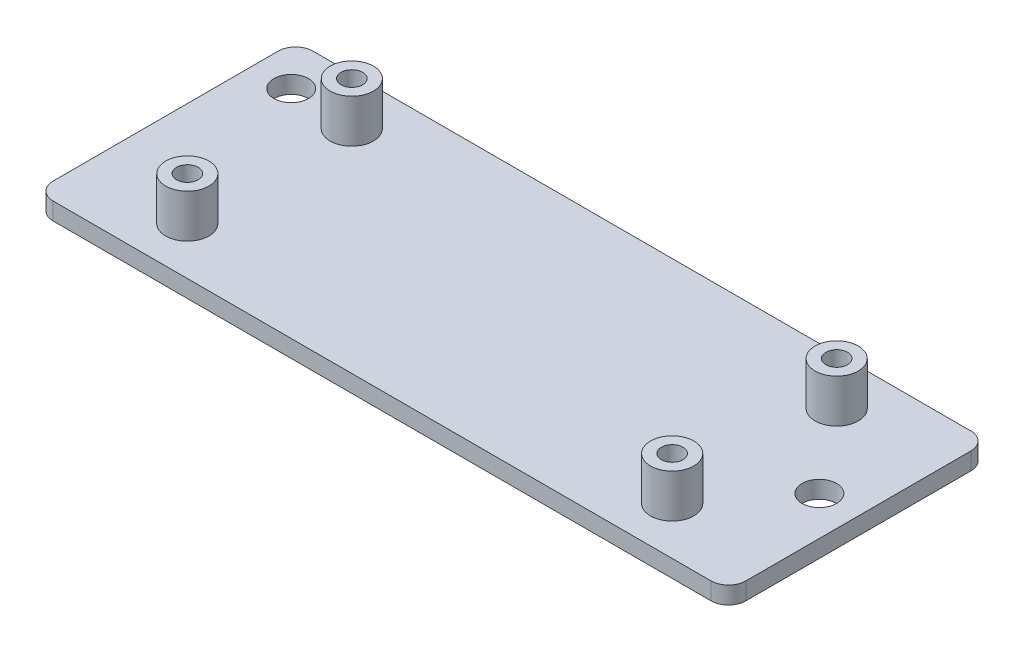
ISO-10303-21;
HEADER;
FILE_DESCRIPTION(('STEP AP214'),'2;1');
FILE_NAME('part.step','',(''),(''),'','','');
FILE_SCHEMA(('AUTOMOTIVE_DESIGN { 1 0 10303 214 1 1 1 1 }'));
ENDSEC;
DATA;
#1=APPLICATION_CONTEXT('core data for automotive mechanical design processes');
#2=APPLICATION_PROTOCOL_DEFINITION('international standard','automotive_design',2000,#1);
#3=PRODUCT_CONTEXT('',#1,'mechanical');
#4=PRODUCT('Part','Part','',(#3));
#5=PRODUCT_RELATED_PRODUCT_CATEGORY('part','',(#4));
#6=PRODUCT_DEFINITION_FORMATION('','',#4);
#7=PRODUCT_DEFINITION_CONTEXT('part definition',#1,'design');
#8=PRODUCT_DEFINITION('design','',#6,#7);
#9=PRODUCT_DEFINITION_SHAPE('','',#8);
#10=(LENGTH_UNIT() NAMED_UNIT(*) SI_UNIT(.MILLI.,.METRE.));
#11=(NAMED_UNIT(*) PLANE_ANGLE_UNIT() SI_UNIT($,.RADIAN.));
#12=(NAMED_UNIT(*) SI_UNIT($,.STERADIAN.) SOLID_ANGLE_UNIT());
#13=UNCERTAINTY_MEASURE_WITH_UNIT(LENGTH_MEASURE(1.E-05),#10,'distance_accuracy_value','');
#14=(GEOMETRIC_REPRESENTATION_CONTEXT(3) GLOBAL_UNCERTAINTY_ASSIGNED_CONTEXT((#13)) GLOBAL_UNIT_ASSIGNED_CONTEXT((#10,
#11,#12)) REPRESENTATION_CONTEXT('',''));
#15=CARTESIAN_POINT('',(0.,0.,0.));
#16=DIRECTION('',(0.,0.,1.));
#17=DIRECTION('',(1.,0.,0.));
#18=AXIS2_PLACEMENT_3D('',#15,#16,#17);
#19=CARTESIAN_POINT('',(78.,2.,28.));
#20=DIRECTION('',(0.,-1.,0.));
#21=DIRECTION('',(0.,0.,-1.));
#22=AXIS2_PLACEMENT_3D('',#19,#20,#21);
#23=CYLINDRICAL_SURFACE('',#22,2.);
#24=DIRECTION('',(0.,-1.,0.));
#25=VECTOR('',#24,1.);
#26=CARTESIAN_POINT('',(80.,2.,28.));
#27=LINE('',#26,#25);
#28=CARTESIAN_POINT('',(80.,2.,28.));
#29=VERTEX_POINT('',#28);
#30=CARTESIAN_POINT('',(80.,0.,28.));
#31=VERTEX_POINT('',#30);
#32=EDGE_CURVE('E150',#29,#31,#27,.T.);
#33=ORIENTED_EDGE('',*,*,#32,.F.);
#34=CARTESIAN_POINT('',(78.,2.,28.));
#35=DIRECTION('',(0.,1.,0.));
#36=DIRECTION('',(0.,0.,1.));
#37=AXIS2_PLACEMENT_3D('',#34,#35,#36);
#38=CIRCLE('',#37,2.);
#39=CARTESIAN_POINT('',(78.,2.,30.));
#40=VERTEX_POINT('',#39);
#41=EDGE_CURVE('E42',#40,#29,#38,.T.);
#42=ORIENTED_EDGE('',*,*,#41,.F.);
#43=DIRECTION('',(0.,-1.,0.));
#44=VECTOR('',#43,1.);
#45=CARTESIAN_POINT('',(78.,2.,30.));
#46=LINE('',#45,#44);
#47=CARTESIAN_POINT('',(78.,0.,30.));
#48=VERTEX_POINT('',#47);
#49=EDGE_CURVE('E153',#48,#40,#46,.F.);
#50=ORIENTED_EDGE('',*,*,#49,.F.);
#51=CARTESIAN_POINT('',(78.,0.,28.));
#52=DIRECTION('',(0.,1.,0.));
#53=DIRECTION('',(0.,0.,1.));
#54=AXIS2_PLACEMENT_3D('',#51,#52,#53);
#55=CIRCLE('',#54,2.);
#56=EDGE_CURVE('E11',#31,#48,#55,.F.);
#57=ORIENTED_EDGE('',*,*,#56,.F.);
#58=EDGE_LOOP('',(#33,#42,#50,#57));
#59=FACE_BOUND('',#58,.T.);
#60=ADVANCED_FACE('F35',(#59),#23,.T.);
#61=CARTESIAN_POINT('',(78.,2.,2.));
#62=DIRECTION('',(0.,-1.,0.));
#63=DIRECTION('',(0.,0.,-1.));
#64=AXIS2_PLACEMENT_3D('',#61,#62,#63);
#65=CYLINDRICAL_SURFACE('',#64,2.);
#66=DIRECTION('',(0.,-1.,0.));
#67=VECTOR('',#66,1.);
#68=CARTESIAN_POINT('',(78.,2.,0.));
#69=LINE('',#68,#67);
#70=CARTESIAN_POINT('',(78.,2.,0.));
#71=VERTEX_POINT('',#70);
#72=CARTESIAN_POINT('',(78.,0.,0.));
#73=VERTEX_POINT('',#72);
#74=EDGE_CURVE('E139',#71,#73,#69,.T.);
#75=ORIENTED_EDGE('',*,*,#74,.F.);
#76=CARTESIAN_POINT('',(78.,2.,2.));
#77=DIRECTION('',(0.,1.,0.));
#78=DIRECTION('',(0.,0.,1.));
#79=AXIS2_PLACEMENT_3D('',#76,#77,#78);
#80=CIRCLE('',#79,2.);
#81=CARTESIAN_POINT('',(80.,2.,2.));
#82=VERTEX_POINT('',#81);
#83=EDGE_CURVE('E145',#82,#71,#80,.T.);
#84=ORIENTED_EDGE('',*,*,#83,.F.);
#85=DIRECTION('',(0.,-1.,0.));
#86=VECTOR('',#85,1.);
#87=CARTESIAN_POINT('',(80.,2.,2.));
#88=LINE('',#87,#86);
#89=CARTESIAN_POINT('',(80.,0.,2.));
#90=VERTEX_POINT('',#89);
#91=EDGE_CURVE('E142',#90,#82,#88,.F.);
#92=ORIENTED_EDGE('',*,*,#91,.F.);
#93=CARTESIAN_POINT('',(78.,0.,2.));
#94=DIRECTION('',(0.,1.,0.));
#95=DIRECTION('',(0.,0.,1.));
#96=AXIS2_PLACEMENT_3D('',#93,#94,#95);
#97=CIRCLE('',#96,2.);
#98=EDGE_CURVE('E147',#73,#90,#97,.F.);
#99=ORIENTED_EDGE('',*,*,#98,.F.);
#100=EDGE_LOOP('',(#75,#84,#92,#99));
#101=FACE_BOUND('',#100,.T.);
#102=ADVANCED_FACE('F223',(#101),#65,.T.);
#103=CARTESIAN_POINT('',(2.,2.,2.));
#104=DIRECTION('',(0.,1.,0.));
#105=DIRECTION('',(0.,0.,1.));
#106=AXIS2_PLACEMENT_3D('',#103,#104,#105);
#107=CYLINDRICAL_SURFACE('',#106,2.);
#108=DIRECTION('',(0.,1.,0.));
#109=VECTOR('',#108,1.);
#110=CARTESIAN_POINT('',(2.,2.,0.));
#111=LINE('',#110,#109);
#112=CARTESIAN_POINT('',(2.,0.,0.));
#113=VERTEX_POINT('',#112);
#114=CARTESIAN_POINT('',(2.,2.,0.));
#115=VERTEX_POINT('',#114);
#116=EDGE_CURVE('E131',#113,#115,#111,.T.);
#117=ORIENTED_EDGE('',*,*,#116,.F.);
#118=CARTESIAN_POINT('',(2.,0.,2.));
#119=DIRECTION('',(0.,1.,0.));
#120=DIRECTION('',(0.,0.,1.));
#121=AXIS2_PLACEMENT_3D('',#118,#119,#120);
#122=CIRCLE('',#121,2.);
#123=CARTESIAN_POINT('',(0.,0.,2.));
#124=VERTEX_POINT('',#123);
#125=EDGE_CURVE('E135',#124,#113,#122,.F.);
#126=ORIENTED_EDGE('',*,*,#125,.F.);
#127=DIRECTION('',(0.,1.,0.));
#128=VECTOR('',#127,1.);
#129=CARTESIAN_POINT('',(0.,2.,2.));
#130=LINE('',#129,#128);
#131=CARTESIAN_POINT('',(0.,2.,2.));
#132=VERTEX_POINT('',#131);
#133=EDGE_CURVE('E105',#132,#124,#130,.F.);
#134=ORIENTED_EDGE('',*,*,#133,.F.);
#135=CARTESIAN_POINT('',(2.,2.,2.));
#136=DIRECTION('',(0.,1.,0.));
#137=DIRECTION('',(0.,0.,1.));
#138=AXIS2_PLACEMENT_3D('',#135,#136,#137);
#139=CIRCLE('',#138,2.);
#140=EDGE_CURVE('E137',#115,#132,#139,.T.);
#141=ORIENTED_EDGE('',*,*,#140,.F.);
#142=EDGE_LOOP('',(#117,#126,#134,#141));
#143=FACE_BOUND('',#142,.T.);
#144=ADVANCED_FACE('F217',(#143),#107,.T.);
#145=CARTESIAN_POINT('',(2.,2.,28.));
#146=DIRECTION('',(0.,1.,0.));
#147=DIRECTION('',(0.,0.,1.));
#148=AXIS2_PLACEMENT_3D('',#145,#146,#147);
#149=CYLINDRICAL_SURFACE('',#148,2.);
#150=DIRECTION('',(0.,1.,0.));
#151=VECTOR('',#150,1.);
#152=CARTESIAN_POINT('',(0.,2.,28.));
#153=LINE('',#152,#151);
#154=CARTESIAN_POINT('',(0.,0.,28.));
#155=VERTEX_POINT('',#154);
#156=CARTESIAN_POINT('',(0.,2.,28.));
#157=VERTEX_POINT('',#156);
#158=EDGE_CURVE('E103',#155,#157,#153,.T.);
#159=ORIENTED_EDGE('',*,*,#158,.F.);
#160=CARTESIAN_POINT('',(2.,0.,28.));
#161=DIRECTION('',(0.,1.,0.));
#162=DIRECTION('',(0.,0.,1.));
#163=AXIS2_PLACEMENT_3D('',#160,#161,#162);
#164=CIRCLE('',#163,2.);
#165=CARTESIAN_POINT('',(2.,0.,30.));
#166=VERTEX_POINT('',#165);
#167=EDGE_CURVE('E110',#166,#155,#164,.F.);
#168=ORIENTED_EDGE('',*,*,#167,.F.);
#169=DIRECTION('',(0.,1.,0.));
#170=VECTOR('',#169,1.);
#171=CARTESIAN_POINT('',(2.,2.,30.));
#172=LINE('',#171,#170);
#173=CARTESIAN_POINT('',(2.,2.,30.));
#174=VERTEX_POINT('',#173);
#175=EDGE_CURVE('E117',#174,#166,#172,.F.);
#176=ORIENTED_EDGE('',*,*,#175,.F.);
#177=CARTESIAN_POINT('',(2.,2.,28.));
#178=DIRECTION('',(0.,1.,0.));
#179=DIRECTION('',(0.,0.,1.));
#180=AXIS2_PLACEMENT_3D('',#177,#178,#179);
#181=CIRCLE('',#180,2.);
#182=EDGE_CURVE('E116',#157,#174,#181,.T.);
#183=ORIENTED_EDGE('',*,*,#182,.F.);
#184=EDGE_LOOP('',(#159,#168,#176,#183));
#185=FACE_BOUND('',#184,.T.);
#186=ADVANCED_FACE('F120',(#185),#149,.T.);
#187=CARTESIAN_POINT('',(0.,2.,0.));
#188=DIRECTION('',(1.,0.,0.));
#189=DIRECTION('',(0.,0.,-1.));
#190=AXIS2_PLACEMENT_3D('',#187,#188,#189);
#191=PLANE('',#190);
#192=DIRECTION('',(0.,0.,1.));
#193=VECTOR('',#192,1.);
#194=CARTESIAN_POINT('',(0.,2.,0.));
#195=LINE('',#194,#193);
#196=EDGE_CURVE('E165',#132,#157,#195,.T.);
#197=ORIENTED_EDGE('',*,*,#196,.F.);
#198=ORIENTED_EDGE('',*,*,#133,.T.);
#199=DIRECTION('',(0.,0.,1.));
#200=VECTOR('',#199,1.);
#201=CARTESIAN_POINT('',(0.,0.,0.));
#202=LINE('',#201,#200);
#203=EDGE_CURVE('E98',#124,#155,#202,.T.);
#204=ORIENTED_EDGE('',*,*,#203,.T.);
#205=ORIENTED_EDGE('',*,*,#158,.T.);
#206=EDGE_LOOP('',(#197,#198,#204,#205));
#207=FACE_BOUND('',#206,.T.);
#208=ADVANCED_FACE('F101',(#207),#191,.F.);
#209=CARTESIAN_POINT('',(0.,2.,30.));
#210=DIRECTION('',(0.,0.,-1.));
#211=DIRECTION('',(-1.,0.,0.));
#212=AXIS2_PLACEMENT_3D('',#209,#210,#211);
#213=PLANE('',#212);
#214=DIRECTION('',(1.,0.,0.));
#215=VECTOR('',#214,1.);
#216=CARTESIAN_POINT('',(0.,0.,30.));
#217=LINE('',#216,#215);
#218=EDGE_CURVE('E107',#166,#48,#217,.T.);
#219=ORIENTED_EDGE('',*,*,#218,.T.);
#220=ORIENTED_EDGE('',*,*,#49,.T.);
#221=DIRECTION('',(1.,0.,0.));
#222=VECTOR('',#221,1.);
#223=CARTESIAN_POINT('',(0.,2.,30.));
#224=LINE('',#223,#222);
#225=EDGE_CURVE('E160',#174,#40,#224,.T.);
#226=ORIENTED_EDGE('',*,*,#225,.F.);
#227=ORIENTED_EDGE('',*,*,#175,.T.);
#228=EDGE_LOOP('',(#219,#220,#226,#227));
#229=FACE_BOUND('',#228,.T.);
#230=ADVANCED_FACE('F235',(#229),#213,.F.);
#231=CARTESIAN_POINT('',(80.,2.,0.));
#232=DIRECTION('',(-1.,0.,0.));
#233=DIRECTION('',(0.,0.,1.));
#234=AXIS2_PLACEMENT_3D('',#231,#232,#233);
#235=PLANE('',#234);
#236=DIRECTION('',(0.,0.,-1.));
#237=VECTOR('',#236,1.);
#238=CARTESIAN_POINT('',(80.,2.,0.));
#239=LINE('',#238,#237);
#240=EDGE_CURVE('E124',#29,#82,#239,.T.);
#241=ORIENTED_EDGE('',*,*,#240,.F.);
#242=ORIENTED_EDGE('',*,*,#32,.T.);
#243=DIRECTION('',(0.,0.,-1.));
#244=VECTOR('',#243,1.);
#245=CARTESIAN_POINT('',(80.,0.,0.));
#246=LINE('',#245,#244);
#247=EDGE_CURVE('E170',#31,#90,#246,.T.);
#248=ORIENTED_EDGE('',*,*,#247,.T.);
#249=ORIENTED_EDGE('',*,*,#91,.T.);
#250=EDGE_LOOP('',(#241,#242,#248,#249));
#251=FACE_BOUND('',#250,.T.);
#252=ADVANCED_FACE('F162',(#251),#235,.F.);
#253=CARTESIAN_POINT('',(0.,2.,0.));
#254=DIRECTION('',(0.,0.,1.));
#255=DIRECTION('',(1.,0.,0.));
#256=AXIS2_PLACEMENT_3D('',#253,#254,#255);
#257=PLANE('',#256);
#258=DIRECTION('',(-1.,0.,0.));
#259=VECTOR('',#258,1.);
#260=CARTESIAN_POINT('',(0.,2.,0.));
#261=LINE('',#260,#259);
#262=EDGE_CURVE('E121',#71,#115,#261,.T.);
#263=ORIENTED_EDGE('',*,*,#262,.F.);
#264=ORIENTED_EDGE('',*,*,#74,.T.);
#265=DIRECTION('',(-1.,0.,0.));
#266=VECTOR('',#265,1.);
#267=CARTESIAN_POINT('',(0.,0.,0.));
#268=LINE('',#267,#266);
#269=EDGE_CURVE('E172',#73,#113,#268,.T.);
#270=ORIENTED_EDGE('',*,*,#269,.T.);
#271=ORIENTED_EDGE('',*,*,#116,.T.);
#272=EDGE_LOOP('',(#263,#264,#270,#271));
#273=FACE_BOUND('',#272,.T.);
#274=ADVANCED_FACE('F220',(#273),#257,.F.);
#275=CARTESIAN_POINT('',(0.,2.,0.));
#276=DIRECTION('',(0.,1.,0.));
#277=DIRECTION('',(0.,0.,1.));
#278=AXIS2_PLACEMENT_3D('',#275,#276,#277);
#279=PLANE('',#278);
#280=CARTESIAN_POINT('',(4.5,2.,5.));
#281=DIRECTION('',(0.,1.,0.));
#282=DIRECTION('',(0.,0.,1.));
#283=AXIS2_PLACEMENT_3D('',#280,#281,#282);
#284=CIRCLE('',#283,2.);
#285=CARTESIAN_POINT('',(4.5,2.,7.));
#286=VERTEX_POINT('',#285);
#287=EDGE_CURVE('E307',#286,#286,#284,.T.);
#288=ORIENTED_EDGE('',*,*,#287,.F.);
#289=EDGE_LOOP('',(#288));
#290=FACE_BOUND('',#289,.T.);
#291=CARTESIAN_POINT('',(75.5,2.,15.));
#292=DIRECTION('',(0.,1.,0.));
#293=DIRECTION('',(0.,0.,1.));
#294=AXIS2_PLACEMENT_3D('',#291,#292,#293);
#295=CIRCLE('',#294,2.);
#296=CARTESIAN_POINT('',(75.5,2.,17.));
#297=VERTEX_POINT('',#296);
#298=EDGE_CURVE('E311',#297,#297,#295,.T.);
#299=ORIENTED_EDGE('',*,*,#298,.F.);
#300=EDGE_LOOP('',(#299));
#301=FACE_BOUND('',#300,.T.);
#302=CARTESIAN_POINT('',(68.,2.,24.5));
#303=DIRECTION('',(0.,1.,0.));
#304=DIRECTION('',(0.,0.,1.));
#305=AXIS2_PLACEMENT_3D('',#302,#303,#304);
#306=CIRCLE('',#305,2.5);
#307=CARTESIAN_POINT('',(68.,2.,27.));
#308=VERTEX_POINT('',#307);
#309=EDGE_CURVE('E185',#308,#308,#306,.T.);
#310=ORIENTED_EDGE('',*,*,#309,.F.);
#311=EDGE_LOOP('',(#310));
#312=FACE_BOUND('',#311,.T.);
#313=CARTESIAN_POINT('',(68.,2.,5.5));
#314=DIRECTION('',(0.,1.,0.));
#315=DIRECTION('',(0.,0.,1.));
#316=AXIS2_PLACEMENT_3D('',#313,#314,#315);
#317=CIRCLE('',#316,2.5);
#318=CARTESIAN_POINT('',(68.,2.,7.99999999999999));
#319=VERTEX_POINT('',#318);
#320=EDGE_CURVE('E194',#319,#319,#317,.T.);
#321=ORIENTED_EDGE('',*,*,#320,.F.);
#322=EDGE_LOOP('',(#321));
#323=FACE_BOUND('',#322,.T.);
#324=CARTESIAN_POINT('',(12.,2.,24.5));
#325=DIRECTION('',(0.,1.,0.));
#326=DIRECTION('',(0.,0.,1.));
#327=AXIS2_PLACEMENT_3D('',#324,#325,#326);
#328=CIRCLE('',#327,2.5);
#329=CARTESIAN_POINT('',(12.,2.,27.));
#330=VERTEX_POINT('',#329);
#331=EDGE_CURVE('E201',#330,#330,#328,.T.);
#332=ORIENTED_EDGE('',*,*,#331,.F.);
#333=EDGE_LOOP('',(#332));
#334=FACE_BOUND('',#333,.T.);
#335=CARTESIAN_POINT('',(12.,2.,5.5));
#336=DIRECTION('',(0.,1.,0.));
#337=DIRECTION('',(0.,0.,1.));
#338=AXIS2_PLACEMENT_3D('',#335,#336,#337);
#339=CIRCLE('',#338,2.5);
#340=CARTESIAN_POINT('',(12.,2.,8.));
#341=VERTEX_POINT('',#340);
#342=EDGE_CURVE('E207',#341,#341,#339,.T.);
#343=ORIENTED_EDGE('',*,*,#342,.F.);
#344=EDGE_LOOP('',(#343));
#345=FACE_BOUND('',#344,.T.);
#346=ORIENTED_EDGE('',*,*,#225,.T.);
#347=ORIENTED_EDGE('',*,*,#41,.T.);
#348=ORIENTED_EDGE('',*,*,#240,.T.);
#349=ORIENTED_EDGE('',*,*,#83,.T.);
#350=ORIENTED_EDGE('',*,*,#262,.T.);
#351=ORIENTED_EDGE('',*,*,#140,.T.);
#352=ORIENTED_EDGE('',*,*,#196,.T.);
#353=ORIENTED_EDGE('',*,*,#182,.T.);
#354=EDGE_LOOP('',(#346,#347,#348,#349,#350,#351,#352,#353));
#355=FACE_BOUND('',#354,.T.);
#356=ADVANCED_FACE('F156',(#290,#301,#312,#323,#334,#345,#355),#279,.T.);
#357=CARTESIAN_POINT('',(0.,0.,0.));
#358=DIRECTION('',(0.,1.,0.));
#359=DIRECTION('',(0.,0.,1.));
#360=AXIS2_PLACEMENT_3D('',#357,#358,#359);
#361=PLANE('',#360);
#362=CARTESIAN_POINT('',(4.5,0.,5.));
#363=DIRECTION('',(0.,1.,0.));
#364=DIRECTION('',(0.,0.,1.));
#365=AXIS2_PLACEMENT_3D('',#362,#363,#364);
#366=CIRCLE('',#365,2.);
#367=CARTESIAN_POINT('',(4.5,0.,7.));
#368=VERTEX_POINT('',#367);
#369=EDGE_CURVE('E310',#368,#368,#366,.T.);
#370=ORIENTED_EDGE('',*,*,#369,.T.);
#371=EDGE_LOOP('',(#370));
#372=FACE_BOUND('',#371,.T.);
#373=CARTESIAN_POINT('',(75.5,0.,15.));
#374=DIRECTION('',(0.,1.,0.));
#375=DIRECTION('',(0.,0.,1.));
#376=AXIS2_PLACEMENT_3D('',#373,#374,#375);
#377=CIRCLE('',#376,2.);
#378=CARTESIAN_POINT('',(75.5,0.,17.));
#379=VERTEX_POINT('',#378);
#380=EDGE_CURVE('E312',#379,#379,#377,.T.);
#381=ORIENTED_EDGE('',*,*,#380,.T.);
#382=EDGE_LOOP('',(#381));
#383=FACE_BOUND('',#382,.T.);
#384=CARTESIAN_POINT('',(12.,0.,24.5));
#385=DIRECTION('',(0.,1.,0.));
#386=DIRECTION('',(0.,0.,1.));
#387=AXIS2_PLACEMENT_3D('',#384,#385,#386);
#388=CIRCLE('',#387,1.25);
#389=CARTESIAN_POINT('',(12.,0.,25.75));
#390=VERTEX_POINT('',#389);
#391=EDGE_CURVE('E324',#390,#390,#388,.T.);
#392=ORIENTED_EDGE('',*,*,#391,.T.);
#393=EDGE_LOOP('',(#392));
#394=FACE_BOUND('',#393,.T.);
#395=CARTESIAN_POINT('',(68.,0.,5.5));
#396=DIRECTION('',(0.,1.,0.));
#397=DIRECTION('',(0.,0.,1.));
#398=AXIS2_PLACEMENT_3D('',#395,#396,#397);
#399=CIRCLE('',#398,1.25);
#400=CARTESIAN_POINT('',(68.,0.,6.75));
#401=VERTEX_POINT('',#400);
#402=EDGE_CURVE('E323',#401,#401,#399,.T.);
#403=ORIENTED_EDGE('',*,*,#402,.T.);
#404=EDGE_LOOP('',(#403));
#405=FACE_BOUND('',#404,.T.);
#406=CARTESIAN_POINT('',(68.,0.,24.5));
#407=DIRECTION('',(0.,1.,0.));
#408=DIRECTION('',(0.,0.,1.));
#409=AXIS2_PLACEMENT_3D('',#406,#407,#408);
#410=CIRCLE('',#409,1.25);
#411=CARTESIAN_POINT('',(68.,0.,25.75));
#412=VERTEX_POINT('',#411);
#413=EDGE_CURVE('E320',#412,#412,#410,.T.);
#414=ORIENTED_EDGE('',*,*,#413,.T.);
#415=EDGE_LOOP('',(#414));
#416=FACE_BOUND('',#415,.T.);
#417=CARTESIAN_POINT('',(12.,0.,5.5));
#418=DIRECTION('',(0.,1.,0.));
#419=DIRECTION('',(0.,0.,1.));
#420=AXIS2_PLACEMENT_3D('',#417,#418,#419);
#421=CIRCLE('',#420,1.25);
#422=CARTESIAN_POINT('',(12.,0.,6.75));
#423=VERTEX_POINT('',#422);
#424=EDGE_CURVE('E178',#423,#423,#421,.T.);
#425=ORIENTED_EDGE('',*,*,#424,.T.);
#426=EDGE_LOOP('',(#425));
#427=FACE_BOUND('',#426,.T.);
#428=ORIENTED_EDGE('',*,*,#247,.F.);
#429=ORIENTED_EDGE('',*,*,#56,.T.);
#430=ORIENTED_EDGE('',*,*,#218,.F.);
#431=ORIENTED_EDGE('',*,*,#167,.T.);
#432=ORIENTED_EDGE('',*,*,#203,.F.);
#433=ORIENTED_EDGE('',*,*,#125,.T.);
#434=ORIENTED_EDGE('',*,*,#269,.F.);
#435=ORIENTED_EDGE('',*,*,#98,.T.);
#436=EDGE_LOOP('',(#428,#429,#430,#431,#432,#433,#434,#435));
#437=FACE_BOUND('',#436,.T.);
#438=ADVANCED_FACE('F111',(#372,#383,#394,#405,#416,#427,#437),#361,.F.);
#439=CARTESIAN_POINT('',(12.,7.,5.5));
#440=DIRECTION('',(0.,-1.,0.));
#441=DIRECTION('',(0.,0.,-1.));
#442=AXIS2_PLACEMENT_3D('',#439,#440,#441);
#443=CYLINDRICAL_SURFACE('',#442,2.5);
#444=CARTESIAN_POINT('',(12.,7.,5.5));
#445=DIRECTION('',(0.,1.,0.));
#446=DIRECTION('',(0.,0.,1.));
#447=AXIS2_PLACEMENT_3D('',#444,#445,#446);
#448=CIRCLE('',#447,2.5);
#449=CARTESIAN_POINT('',(12.,7.,8.));
#450=VERTEX_POINT('',#449);
#451=EDGE_CURVE('E108',#450,#450,#448,.T.);
#452=ORIENTED_EDGE('',*,*,#451,.F.);
#453=EDGE_LOOP('',(#452));
#454=FACE_BOUND('',#453,.T.);
#455=ORIENTED_EDGE('',*,*,#342,.T.);
#456=EDGE_LOOP('',(#455));
#457=FACE_BOUND('',#456,.T.);
#458=ADVANCED_FACE('F245',(#454,#457),#443,.T.);
#459=CARTESIAN_POINT('',(12.,7.,5.5));
#460=DIRECTION('',(0.,1.,0.));
#461=DIRECTION('',(0.,0.,1.));
#462=AXIS2_PLACEMENT_3D('',#459,#460,#461);
#463=PLANE('',#462);
#464=CARTESIAN_POINT('',(12.,7.,5.5));
#465=DIRECTION('',(0.,1.,0.));
#466=DIRECTION('',(0.,0.,1.));
#467=AXIS2_PLACEMENT_3D('',#464,#465,#466);
#468=CIRCLE('',#467,1.25);
#469=CARTESIAN_POINT('',(12.,7.,6.75));
#470=VERTEX_POINT('',#469);
#471=EDGE_CURVE('E127',#470,#470,#468,.T.);
#472=ORIENTED_EDGE('',*,*,#471,.F.);
#473=EDGE_LOOP('',(#472));
#474=FACE_BOUND('',#473,.T.);
#475=ORIENTED_EDGE('',*,*,#451,.T.);
#476=EDGE_LOOP('',(#475));
#477=FACE_BOUND('',#476,.T.);
#478=ADVANCED_FACE('F252',(#474,#477),#463,.T.);
#479=CARTESIAN_POINT('',(12.,7.,24.5));
#480=DIRECTION('',(0.,-1.,0.));
#481=DIRECTION('',(0.,0.,-1.));
#482=AXIS2_PLACEMENT_3D('',#479,#480,#481);
#483=CYLINDRICAL_SURFACE('',#482,2.5);
#484=CARTESIAN_POINT('',(12.,7.,24.5));
#485=DIRECTION('',(0.,1.,0.));
#486=DIRECTION('',(0.,0.,1.));
#487=AXIS2_PLACEMENT_3D('',#484,#485,#486);
#488=CIRCLE('',#487,2.5);
#489=CARTESIAN_POINT('',(12.,7.,27.));
#490=VERTEX_POINT('',#489);
#491=EDGE_CURVE('E204',#490,#490,#488,.T.);
#492=ORIENTED_EDGE('',*,*,#491,.F.);
#493=EDGE_LOOP('',(#492));
#494=FACE_BOUND('',#493,.T.);
#495=ORIENTED_EDGE('',*,*,#331,.T.);
#496=EDGE_LOOP('',(#495));
#497=FACE_BOUND('',#496,.T.);
#498=ADVANCED_FACE('F256',(#494,#497),#483,.T.);
#499=CARTESIAN_POINT('',(12.,7.,24.5));
#500=DIRECTION('',(0.,1.,0.));
#501=DIRECTION('',(0.,0.,1.));
#502=AXIS2_PLACEMENT_3D('',#499,#500,#501);
#503=PLANE('',#502);
#504=CARTESIAN_POINT('',(12.,7.,24.5));
#505=DIRECTION('',(0.,1.,0.));
#506=DIRECTION('',(0.,0.,1.));
#507=AXIS2_PLACEMENT_3D('',#504,#505,#506);
#508=CIRCLE('',#507,1.25);
#509=CARTESIAN_POINT('',(12.,7.,25.75));
#510=VERTEX_POINT('',#509);
#511=EDGE_CURVE('E180',#510,#510,#508,.T.);
#512=ORIENTED_EDGE('',*,*,#511,.F.);
#513=EDGE_LOOP('',(#512));
#514=FACE_BOUND('',#513,.T.);
#515=ORIENTED_EDGE('',*,*,#491,.T.);
#516=EDGE_LOOP('',(#515));
#517=FACE_BOUND('',#516,.T.);
#518=ADVANCED_FACE('F260',(#514,#517),#503,.T.);
#519=CARTESIAN_POINT('',(68.,7.,5.5));
#520=DIRECTION('',(0.,-1.,0.));
#521=DIRECTION('',(0.,0.,-1.));
#522=AXIS2_PLACEMENT_3D('',#519,#520,#521);
#523=CYLINDRICAL_SURFACE('',#522,2.5);
#524=CARTESIAN_POINT('',(68.,7.,5.5));
#525=DIRECTION('',(0.,1.,0.));
#526=DIRECTION('',(0.,0.,1.));
#527=AXIS2_PLACEMENT_3D('',#524,#525,#526);
#528=CIRCLE('',#527,2.5);
#529=CARTESIAN_POINT('',(68.,7.,7.99999999999999));
#530=VERTEX_POINT('',#529);
#531=EDGE_CURVE('E198',#530,#530,#528,.T.);
#532=ORIENTED_EDGE('',*,*,#531,.F.);
#533=EDGE_LOOP('',(#532));
#534=FACE_BOUND('',#533,.T.);
#535=ORIENTED_EDGE('',*,*,#320,.T.);
#536=EDGE_LOOP('',(#535));
#537=FACE_BOUND('',#536,.T.);
#538=ADVANCED_FACE('F264',(#534,#537),#523,.T.);
#539=CARTESIAN_POINT('',(68.,7.,5.5));
#540=DIRECTION('',(0.,1.,0.));
#541=DIRECTION('',(0.,0.,1.));
#542=AXIS2_PLACEMENT_3D('',#539,#540,#541);
#543=PLANE('',#542);
#544=CARTESIAN_POINT('',(68.,7.,5.5));
#545=DIRECTION('',(0.,1.,0.));
#546=DIRECTION('',(0.,0.,1.));
#547=AXIS2_PLACEMENT_3D('',#544,#545,#546);
#548=CIRCLE('',#547,1.25);
#549=CARTESIAN_POINT('',(68.,7.,6.75));
#550=VERTEX_POINT('',#549);
#551=EDGE_CURVE('E177',#550,#550,#548,.T.);
#552=ORIENTED_EDGE('',*,*,#551,.F.);
#553=EDGE_LOOP('',(#552));
#554=FACE_BOUND('',#553,.T.);
#555=ORIENTED_EDGE('',*,*,#531,.T.);
#556=EDGE_LOOP('',(#555));
#557=FACE_BOUND('',#556,.T.);
#558=ADVANCED_FACE('F268',(#554,#557),#543,.T.);
#559=CARTESIAN_POINT('',(68.,7.,24.5));
#560=DIRECTION('',(0.,-1.,0.));
#561=DIRECTION('',(0.,0.,-1.));
#562=AXIS2_PLACEMENT_3D('',#559,#560,#561);
#563=CYLINDRICAL_SURFACE('',#562,2.5);
#564=CARTESIAN_POINT('',(68.,7.,24.5));
#565=DIRECTION('',(0.,1.,0.));
#566=DIRECTION('',(0.,0.,1.));
#567=AXIS2_PLACEMENT_3D('',#564,#565,#566);
#568=CIRCLE('',#567,2.5);
#569=CARTESIAN_POINT('',(68.,7.,27.));
#570=VERTEX_POINT('',#569);
#571=EDGE_CURVE('E189',#570,#570,#568,.T.);
#572=ORIENTED_EDGE('',*,*,#571,.F.);
#573=EDGE_LOOP('',(#572));
#574=FACE_BOUND('',#573,.T.);
#575=ORIENTED_EDGE('',*,*,#309,.T.);
#576=EDGE_LOOP('',(#575));
#577=FACE_BOUND('',#576,.T.);
#578=ADVANCED_FACE('F272',(#574,#577),#563,.T.);
#579=CARTESIAN_POINT('',(68.,7.,24.5));
#580=DIRECTION('',(0.,1.,0.));
#581=DIRECTION('',(0.,0.,1.));
#582=AXIS2_PLACEMENT_3D('',#579,#580,#581);
#583=PLANE('',#582);
#584=CARTESIAN_POINT('',(68.,7.,24.5));
#585=DIRECTION('',(0.,1.,0.));
#586=DIRECTION('',(0.,0.,1.));
#587=AXIS2_PLACEMENT_3D('',#584,#585,#586);
#588=CIRCLE('',#587,1.25);
#589=CARTESIAN_POINT('',(68.,7.,25.75));
#590=VERTEX_POINT('',#589);
#591=EDGE_CURVE('E174',#590,#590,#588,.T.);
#592=ORIENTED_EDGE('',*,*,#591,.F.);
#593=EDGE_LOOP('',(#592));
#594=FACE_BOUND('',#593,.T.);
#595=ORIENTED_EDGE('',*,*,#571,.T.);
#596=EDGE_LOOP('',(#595));
#597=FACE_BOUND('',#596,.T.);
#598=ADVANCED_FACE('F276',(#594,#597),#583,.T.);
#599=CARTESIAN_POINT('',(68.,0.,24.5));
#600=DIRECTION('',(0.,1.,0.));
#601=DIRECTION('',(0.,0.,1.));
#602=AXIS2_PLACEMENT_3D('',#599,#600,#601);
#603=CYLINDRICAL_SURFACE('',#602,1.25);
#604=ORIENTED_EDGE('',*,*,#591,.T.);
#605=EDGE_LOOP('',(#604));
#606=FACE_BOUND('',#605,.T.);
#607=ORIENTED_EDGE('',*,*,#413,.F.);
#608=EDGE_LOOP('',(#607));
#609=FACE_BOUND('',#608,.T.);
#610=ADVANCED_FACE('F280',(#606,#609),#603,.F.);
#611=CARTESIAN_POINT('',(68.,0.,5.5));
#612=DIRECTION('',(0.,1.,0.));
#613=DIRECTION('',(0.,0.,1.));
#614=AXIS2_PLACEMENT_3D('',#611,#612,#613);
#615=CYLINDRICAL_SURFACE('',#614,1.25);
#616=ORIENTED_EDGE('',*,*,#551,.T.);
#617=EDGE_LOOP('',(#616));
#618=FACE_BOUND('',#617,.T.);
#619=ORIENTED_EDGE('',*,*,#402,.F.);
#620=EDGE_LOOP('',(#619));
#621=FACE_BOUND('',#620,.T.);
#622=ADVANCED_FACE('F287',(#618,#621),#615,.F.);
#623=CARTESIAN_POINT('',(12.,0.,24.5));
#624=DIRECTION('',(0.,1.,0.));
#625=DIRECTION('',(0.,0.,1.));
#626=AXIS2_PLACEMENT_3D('',#623,#624,#625);
#627=CYLINDRICAL_SURFACE('',#626,1.25);
#628=ORIENTED_EDGE('',*,*,#511,.T.);
#629=EDGE_LOOP('',(#628));
#630=FACE_BOUND('',#629,.T.);
#631=ORIENTED_EDGE('',*,*,#391,.F.);
#632=EDGE_LOOP('',(#631));
#633=FACE_BOUND('',#632,.T.);
#634=ADVANCED_FACE('F286',(#630,#633),#627,.F.);
#635=CARTESIAN_POINT('',(12.,0.,5.5));
#636=DIRECTION('',(0.,1.,0.));
#637=DIRECTION('',(0.,0.,1.));
#638=AXIS2_PLACEMENT_3D('',#635,#636,#637);
#639=CYLINDRICAL_SURFACE('',#638,1.25);
#640=ORIENTED_EDGE('',*,*,#471,.T.);
#641=EDGE_LOOP('',(#640));
#642=FACE_BOUND('',#641,.T.);
#643=ORIENTED_EDGE('',*,*,#424,.F.);
#644=EDGE_LOOP('',(#643));
#645=FACE_BOUND('',#644,.T.);
#646=ADVANCED_FACE('F282',(#642,#645),#639,.F.);
#647=CARTESIAN_POINT('',(75.5,0.,15.));
#648=DIRECTION('',(0.,1.,0.));
#649=DIRECTION('',(0.,0.,1.));
#650=AXIS2_PLACEMENT_3D('',#647,#648,#649);
#651=CYLINDRICAL_SURFACE('',#650,2.);
#652=ORIENTED_EDGE('',*,*,#298,.T.);
#653=EDGE_LOOP('',(#652));
#654=FACE_BOUND('',#653,.T.);
#655=ORIENTED_EDGE('',*,*,#380,.F.);
#656=EDGE_LOOP('',(#655));
#657=FACE_BOUND('',#656,.T.);
#658=ADVANCED_FACE('F285',(#654,#657),#651,.F.);
#659=CARTESIAN_POINT('',(4.5,0.,5.));
#660=DIRECTION('',(0.,1.,0.));
#661=DIRECTION('',(0.,0.,1.));
#662=AXIS2_PLACEMENT_3D('',#659,#660,#661);
#663=CYLINDRICAL_SURFACE('',#662,2.);
#664=ORIENTED_EDGE('',*,*,#287,.T.);
#665=EDGE_LOOP('',(#664));
#666=FACE_BOUND('',#665,.T.);
#667=ORIENTED_EDGE('',*,*,#369,.F.);
#668=EDGE_LOOP('',(#667));
#669=FACE_BOUND('',#668,.T.);
#670=ADVANCED_FACE('F298',(#666,#669),#663,.F.);
#671=CLOSED_SHELL('',(#60,#102,#144,#186,#208,#230,#252,#274,#356,#438,#458,#478,#498,#518,#538,
#558,#578,#598,#610,#622,#634,#646,#658,#670));
#672=MANIFOLD_SOLID_BREP('B2',#671);
#673=ADVANCED_BREP_SHAPE_REPRESENTATION('',(#18,#672),#14);
#674=SHAPE_DEFINITION_REPRESENTATION(#9,#673);
ENDSEC;
END-ISO-10303-21;
